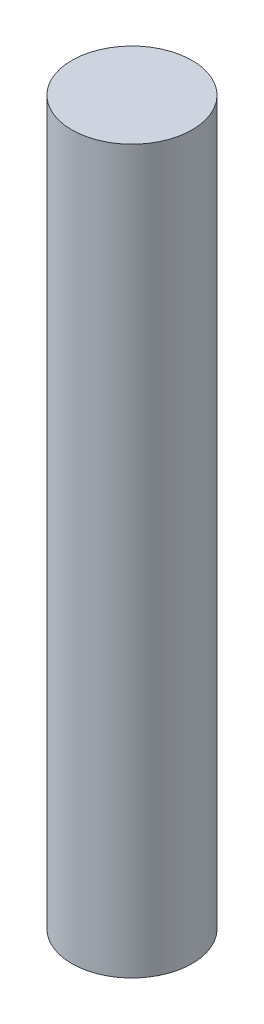
ISO-10303-21;
HEADER;
FILE_DESCRIPTION(('STEP AP214'),'2;1');
FILE_NAME('part.step','',(''),(''),'','','');
FILE_SCHEMA(('AUTOMOTIVE_DESIGN { 1 0 10303 214 1 1 1 1 }'));
ENDSEC;
DATA;
#1=APPLICATION_CONTEXT('core data for automotive mechanical design processes');
#2=APPLICATION_PROTOCOL_DEFINITION('international standard','automotive_design',2000,#1);
#3=PRODUCT_CONTEXT('',#1,'mechanical');
#4=PRODUCT('Part','Part','',(#3));
#5=PRODUCT_RELATED_PRODUCT_CATEGORY('part','',(#4));
#6=PRODUCT_DEFINITION_FORMATION('','',#4);
#7=PRODUCT_DEFINITION_CONTEXT('part definition',#1,'design');
#8=PRODUCT_DEFINITION('design','',#6,#7);
#9=PRODUCT_DEFINITION_SHAPE('','',#8);
#10=(LENGTH_UNIT() NAMED_UNIT(*) SI_UNIT(.MILLI.,.METRE.));
#11=(NAMED_UNIT(*) PLANE_ANGLE_UNIT() SI_UNIT($,.RADIAN.));
#12=(NAMED_UNIT(*) SI_UNIT($,.STERADIAN.) SOLID_ANGLE_UNIT());
#13=UNCERTAINTY_MEASURE_WITH_UNIT(LENGTH_MEASURE(1.E-05),#10,'distance_accuracy_value','');
#14=(GEOMETRIC_REPRESENTATION_CONTEXT(3) GLOBAL_UNCERTAINTY_ASSIGNED_CONTEXT((#13)) GLOBAL_UNIT_ASSIGNED_CONTEXT((#10,
#11,#12)) REPRESENTATION_CONTEXT('',''));
#15=CARTESIAN_POINT('',(0.,0.,0.));
#16=DIRECTION('',(0.,0.,1.));
#17=DIRECTION('',(1.,0.,0.));
#18=AXIS2_PLACEMENT_3D('',#15,#16,#17);
#19=CARTESIAN_POINT('',(0.,76.2,0.));
#20=DIRECTION('',(0.,-1.,0.));
#21=DIRECTION('',(0.,0.,-1.));
#22=AXIS2_PLACEMENT_3D('',#19,#20,#21);
#23=CYLINDRICAL_SURFACE('',#22,6.35);
#24=CARTESIAN_POINT('',(0.,76.2,0.));
#25=DIRECTION('',(0.,1.,0.));
#26=DIRECTION('',(0.,0.,1.));
#27=AXIS2_PLACEMENT_3D('',#24,#25,#26);
#28=CIRCLE('',#27,6.35);
#29=CARTESIAN_POINT('',(0.,76.2,6.35));
#30=VERTEX_POINT('',#29);
#31=EDGE_CURVE('E10',#30,#30,#28,.T.);
#32=ORIENTED_EDGE('',*,*,#31,.F.);
#33=EDGE_LOOP('',(#32));
#34=FACE_BOUND('',#33,.T.);
#35=CARTESIAN_POINT('',(0.,0.,0.));
#36=DIRECTION('',(0.,1.,0.));
#37=DIRECTION('',(0.,0.,1.));
#38=AXIS2_PLACEMENT_3D('',#35,#36,#37);
#39=CIRCLE('',#38,6.35);
#40=CARTESIAN_POINT('',(0.,0.,6.35));
#41=VERTEX_POINT('',#40);
#42=EDGE_CURVE('E34',#41,#41,#39,.T.);
#43=ORIENTED_EDGE('',*,*,#42,.T.);
#44=EDGE_LOOP('',(#43));
#45=FACE_BOUND('',#44,.T.);
#46=ADVANCED_FACE('F31',(#34,#45),#23,.T.);
#47=CARTESIAN_POINT('',(0.,76.2,0.));
#48=DIRECTION('',(0.,1.,0.));
#49=DIRECTION('',(0.,0.,1.));
#50=AXIS2_PLACEMENT_3D('',#47,#48,#49);
#51=PLANE('',#50);
#52=ORIENTED_EDGE('',*,*,#31,.T.);
#53=EDGE_LOOP('',(#52));
#54=FACE_BOUND('',#53,.T.);
#55=ADVANCED_FACE('F46',(#54),#51,.T.);
#56=CARTESIAN_POINT('',(0.,0.,0.));
#57=DIRECTION('',(0.,1.,0.));
#58=DIRECTION('',(0.,0.,1.));
#59=AXIS2_PLACEMENT_3D('',#56,#57,#58);
#60=PLANE('',#59);
#61=ORIENTED_EDGE('',*,*,#42,.F.);
#62=EDGE_LOOP('',(#61));
#63=FACE_BOUND('',#62,.T.);
#64=ADVANCED_FACE('F44',(#63),#60,.F.);
#65=CLOSED_SHELL('',(#46,#55,#64));
#66=MANIFOLD_SOLID_BREP('B2',#65);
#67=ADVANCED_BREP_SHAPE_REPRESENTATION('',(#18,#66),#14);
#68=SHAPE_DEFINITION_REPRESENTATION(#9,#67);
ENDSEC;
END-ISO-10303-21;
